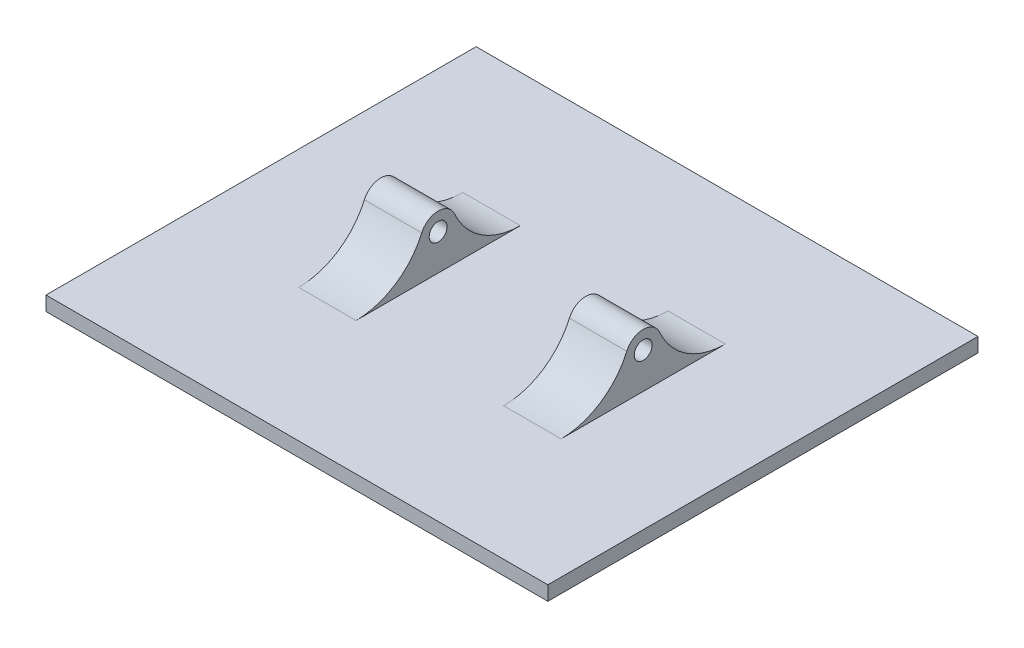
ISO-10303-21;
HEADER;
FILE_DESCRIPTION(('STEP AP214'),'2;1');
FILE_NAME('part.step','',(''),(''),'','','');
FILE_SCHEMA(('AUTOMOTIVE_DESIGN { 1 0 10303 214 1 1 1 1 }'));
ENDSEC;
DATA;
#1=APPLICATION_CONTEXT('core data for automotive mechanical design processes');
#2=APPLICATION_PROTOCOL_DEFINITION('international standard','automotive_design',2000,#1);
#3=PRODUCT_CONTEXT('',#1,'mechanical');
#4=PRODUCT('Part','Part','',(#3));
#5=PRODUCT_RELATED_PRODUCT_CATEGORY('part','',(#4));
#6=PRODUCT_DEFINITION_FORMATION('','',#4);
#7=PRODUCT_DEFINITION_CONTEXT('part definition',#1,'design');
#8=PRODUCT_DEFINITION('design','',#6,#7);
#9=PRODUCT_DEFINITION_SHAPE('','',#8);
#10=(LENGTH_UNIT() NAMED_UNIT(*) SI_UNIT(.MILLI.,.METRE.));
#11=(NAMED_UNIT(*) PLANE_ANGLE_UNIT() SI_UNIT($,.RADIAN.));
#12=(NAMED_UNIT(*) SI_UNIT($,.STERADIAN.) SOLID_ANGLE_UNIT());
#13=UNCERTAINTY_MEASURE_WITH_UNIT(LENGTH_MEASURE(1.E-05),#10,'distance_accuracy_value','');
#14=(GEOMETRIC_REPRESENTATION_CONTEXT(3) GLOBAL_UNCERTAINTY_ASSIGNED_CONTEXT((#13)) GLOBAL_UNIT_ASSIGNED_CONTEXT((#10,
#11,#12)) REPRESENTATION_CONTEXT('',''));
#15=CARTESIAN_POINT('',(0.,0.,0.));
#16=DIRECTION('',(0.,0.,1.));
#17=DIRECTION('',(1.,0.,0.));
#18=AXIS2_PLACEMENT_3D('',#15,#16,#17);
#19=CARTESIAN_POINT('',(27.0710678118655,0.,2.5));
#20=DIRECTION('',(-1.,0.,0.));
#21=DIRECTION('',(0.,0.,1.));
#22=AXIS2_PLACEMENT_3D('',#19,#20,#21);
#23=CYLINDRICAL_SURFACE('',#22,1.25);
#24=CARTESIAN_POINT('',(-24.7,0.,2.5));
#25=DIRECTION('',(-1.,0.,0.));
#26=DIRECTION('',(0.,0.,1.));
#27=AXIS2_PLACEMENT_3D('',#24,#25,#26);
#28=CIRCLE('',#27,1.25);
#29=CARTESIAN_POINT('',(-24.7,0.,3.75));
#30=VERTEX_POINT('',#29);
#31=EDGE_CURVE('E216',#30,#30,#28,.F.);
#32=ORIENTED_EDGE('',*,*,#31,.F.);
#33=EDGE_LOOP('',(#32));
#34=FACE_BOUND('',#33,.T.);
#35=CARTESIAN_POINT('',(-16.7,0.,2.5));
#36=DIRECTION('',(1.,0.,0.));
#37=DIRECTION('',(0.,0.,-1.));
#38=AXIS2_PLACEMENT_3D('',#35,#36,#37);
#39=CIRCLE('',#38,1.25);
#40=CARTESIAN_POINT('',(-16.7,0.,1.25));
#41=VERTEX_POINT('',#40);
#42=EDGE_CURVE('E206',#41,#41,#39,.F.);
#43=ORIENTED_EDGE('',*,*,#42,.F.);
#44=EDGE_LOOP('',(#43));
#45=FACE_BOUND('',#44,.T.);
#46=ADVANCED_FACE('F35',(#34,#45),#23,.F.);
#47=CARTESIAN_POINT('',(-24.7,79.,10.7291332897563));
#48=DIRECTION('',(-1.,0.,0.));
#49=DIRECTION('',(0.,0.,1.));
#50=AXIS2_PLACEMENT_3D('',#47,#48,#49);
#51=PLANE('',#50);
#52=DIRECTION('',(0.,0.,-1.));
#53=VECTOR('',#52,1.);
#54=CARTESIAN_POINT('',(-24.7,-5.,10.7291332897563));
#55=LINE('',#54,#53);
#56=CARTESIAN_POINT('',(-24.7,-5.,13.9564392373896));
#57=VERTEX_POINT('',#56);
#58=CARTESIAN_POINT('',(-24.7,-5.,-8.9564392373896));
#59=VERTEX_POINT('',#58);
#60=EDGE_CURVE('E213',#57,#59,#55,.T.);
#61=ORIENTED_EDGE('',*,*,#60,.F.);
#62=CARTESIAN_POINT('',(-24.7,5.,13.9564392373896));
#63=DIRECTION('',(-1.,0.,0.));
#64=DIRECTION('',(0.,0.,1.));
#65=AXIS2_PLACEMENT_3D('',#62,#63,#64);
#66=CIRCLE('',#65,10.);
#67=CARTESIAN_POINT('',(-24.7,1.,4.79128784747792));
#68=VERTEX_POINT('',#67);
#69=EDGE_CURVE('E182',#57,#68,#66,.F.);
#70=ORIENTED_EDGE('',*,*,#69,.T.);
#71=CARTESIAN_POINT('',(-24.7,0.,2.5));
#72=DIRECTION('',(-1.,0.,0.));
#73=DIRECTION('',(0.,0.,1.));
#74=AXIS2_PLACEMENT_3D('',#71,#72,#73);
#75=CIRCLE('',#74,2.5);
#76=CARTESIAN_POINT('',(-24.7,1.,0.208712152522079));
#77=VERTEX_POINT('',#76);
#78=EDGE_CURVE('E214',#68,#77,#75,.T.);
#79=ORIENTED_EDGE('',*,*,#78,.T.);
#80=CARTESIAN_POINT('',(-24.7,5.,-8.9564392373896));
#81=DIRECTION('',(-1.,0.,0.));
#82=DIRECTION('',(0.,0.,1.));
#83=AXIS2_PLACEMENT_3D('',#80,#81,#82);
#84=CIRCLE('',#83,10.);
#85=EDGE_CURVE('E11',#77,#59,#84,.F.);
#86=ORIENTED_EDGE('',*,*,#85,.T.);
#87=EDGE_LOOP('',(#61,#70,#79,#86));
#88=FACE_BOUND('',#87,.T.);
#89=ORIENTED_EDGE('',*,*,#31,.T.);
#90=EDGE_LOOP('',(#89));
#91=FACE_BOUND('',#90,.T.);
#92=ADVANCED_FACE('F211',(#88,#91),#51,.T.);
#93=CARTESIAN_POINT('',(-45.3,0.,2.5));
#94=DIRECTION('',(1.,0.,0.));
#95=DIRECTION('',(0.,0.,-1.));
#96=AXIS2_PLACEMENT_3D('',#93,#94,#95);
#97=CIRCLE('',#96,1.25);
#98=CARTESIAN_POINT('',(-45.3,0.,1.25));
#99=VERTEX_POINT('',#98);
#100=EDGE_CURVE('E217',#99,#99,#97,.F.);
#101=ORIENTED_EDGE('',*,*,#100,.F.);
#102=EDGE_LOOP('',(#101));
#103=FACE_BOUND('',#102,.T.);
#104=CARTESIAN_POINT('',(-53.3,0.,2.5));
#105=DIRECTION('',(-1.,0.,0.));
#106=DIRECTION('',(0.,0.,1.));
#107=AXIS2_PLACEMENT_3D('',#104,#105,#106);
#108=CIRCLE('',#107,1.25);
#109=CARTESIAN_POINT('',(-53.3,0.,3.75));
#110=VERTEX_POINT('',#109);
#111=EDGE_CURVE('E207',#110,#110,#108,.F.);
#112=ORIENTED_EDGE('',*,*,#111,.F.);
#113=EDGE_LOOP('',(#112));
#114=FACE_BOUND('',#113,.T.);
#115=ADVANCED_FACE('F258',(#103,#114),#23,.F.);
#116=CARTESIAN_POINT('',(-45.3,79.,10.7291332897563));
#117=DIRECTION('',(1.,0.,0.));
#118=DIRECTION('',(0.,0.,-1.));
#119=AXIS2_PLACEMENT_3D('',#116,#117,#118);
#120=PLANE('',#119);
#121=DIRECTION('',(0.,0.,1.));
#122=VECTOR('',#121,1.);
#123=CARTESIAN_POINT('',(-45.3,-5.,10.7291332897563));
#124=LINE('',#123,#122);
#125=CARTESIAN_POINT('',(-45.3,-5.,-8.9564392373896));
#126=VERTEX_POINT('',#125);
#127=CARTESIAN_POINT('',(-45.3,-5.,13.9564392373896));
#128=VERTEX_POINT('',#127);
#129=EDGE_CURVE('E288',#126,#128,#124,.T.);
#130=ORIENTED_EDGE('',*,*,#129,.F.);
#131=CARTESIAN_POINT('',(-45.3,5.,-8.9564392373896));
#132=DIRECTION('',(1.,0.,0.));
#133=DIRECTION('',(0.,0.,-1.));
#134=AXIS2_PLACEMENT_3D('',#131,#132,#133);
#135=CIRCLE('',#134,10.);
#136=CARTESIAN_POINT('',(-45.3,1.,0.208712152522079));
#137=VERTEX_POINT('',#136);
#138=EDGE_CURVE('E58',#126,#137,#135,.F.);
#139=ORIENTED_EDGE('',*,*,#138,.T.);
#140=CARTESIAN_POINT('',(-45.3,0.,2.5));
#141=DIRECTION('',(1.,0.,0.));
#142=DIRECTION('',(0.,0.,-1.));
#143=AXIS2_PLACEMENT_3D('',#140,#141,#142);
#144=CIRCLE('',#143,2.5);
#145=CARTESIAN_POINT('',(-45.3,1.,4.79128784747792));
#146=VERTEX_POINT('',#145);
#147=EDGE_CURVE('E223',#137,#146,#144,.T.);
#148=ORIENTED_EDGE('',*,*,#147,.T.);
#149=CARTESIAN_POINT('',(-45.3,5.,13.9564392373896));
#150=DIRECTION('',(1.,0.,0.));
#151=DIRECTION('',(0.,0.,-1.));
#152=AXIS2_PLACEMENT_3D('',#149,#150,#151);
#153=CIRCLE('',#152,10.);
#154=EDGE_CURVE('E50',#146,#128,#153,.F.);
#155=ORIENTED_EDGE('',*,*,#154,.T.);
#156=EDGE_LOOP('',(#130,#139,#148,#155));
#157=FACE_BOUND('',#156,.T.);
#158=ORIENTED_EDGE('',*,*,#100,.T.);
#159=EDGE_LOOP('',(#158));
#160=FACE_BOUND('',#159,.T.);
#161=ADVANCED_FACE('F268',(#157,#160),#120,.T.);
#162=CARTESIAN_POINT('',(-70.,1.12757025938492E-13,32.5));
#163=DIRECTION('',(0.,0.,1.));
#164=DIRECTION('',(0.,-1.,0.));
#165=AXIS2_PLACEMENT_3D('',#162,#163,#164);
#166=PLANE('',#165);
#167=DIRECTION('',(0.,-1.,0.));
#168=VECTOR('',#167,1.);
#169=CARTESIAN_POINT('',(0.,1.12757025938492E-13,32.5));
#170=LINE('',#169,#168);
#171=CARTESIAN_POINT('',(0.,-5.,32.5));
#172=VERTEX_POINT('',#171);
#173=CARTESIAN_POINT('',(0.,-7.,32.5));
#174=VERTEX_POINT('',#173);
#175=EDGE_CURVE('E233',#172,#174,#170,.T.);
#176=ORIENTED_EDGE('',*,*,#175,.F.);
#177=DIRECTION('',(1.,0.,0.));
#178=VECTOR('',#177,1.);
#179=CARTESIAN_POINT('',(-70.,-5.,32.5));
#180=LINE('',#179,#178);
#181=CARTESIAN_POINT('',(-70.,-5.,32.5));
#182=VERTEX_POINT('',#181);
#183=EDGE_CURVE('E138',#182,#172,#180,.T.);
#184=ORIENTED_EDGE('',*,*,#183,.F.);
#185=DIRECTION('',(0.,-1.,0.));
#186=VECTOR('',#185,1.);
#187=CARTESIAN_POINT('',(-70.,1.12757025938492E-13,32.5));
#188=LINE('',#187,#186);
#189=CARTESIAN_POINT('',(-70.,-7.,32.5));
#190=VERTEX_POINT('',#189);
#191=EDGE_CURVE('E133',#182,#190,#188,.T.);
#192=ORIENTED_EDGE('',*,*,#191,.T.);
#193=DIRECTION('',(1.,0.,0.));
#194=VECTOR('',#193,1.);
#195=CARTESIAN_POINT('',(-70.,-7.,32.5));
#196=LINE('',#195,#194);
#197=EDGE_CURVE('E157',#190,#174,#196,.T.);
#198=ORIENTED_EDGE('',*,*,#197,.T.);
#199=EDGE_LOOP('',(#176,#184,#192,#198));
#200=FACE_BOUND('',#199,.T.);
#201=ADVANCED_FACE('F240',(#200),#166,.T.);
#202=CARTESIAN_POINT('',(-70.,-7.,0.));
#203=DIRECTION('',(0.,-1.,0.));
#204=DIRECTION('',(0.,0.,-1.));
#205=AXIS2_PLACEMENT_3D('',#202,#203,#204);
#206=PLANE('',#205);
#207=DIRECTION('',(0.,0.,-1.));
#208=VECTOR('',#207,1.);
#209=CARTESIAN_POINT('',(0.,-7.,0.));
#210=LINE('',#209,#208);
#211=CARTESIAN_POINT('',(0.,-7.,-27.5));
#212=VERTEX_POINT('',#211);
#213=EDGE_CURVE('E230',#174,#212,#210,.T.);
#214=ORIENTED_EDGE('',*,*,#213,.F.);
#215=ORIENTED_EDGE('',*,*,#197,.F.);
#216=DIRECTION('',(0.,0.,-1.));
#217=VECTOR('',#216,1.);
#218=CARTESIAN_POINT('',(-70.,-7.,0.));
#219=LINE('',#218,#217);
#220=CARTESIAN_POINT('',(-70.,-7.,-27.5));
#221=VERTEX_POINT('',#220);
#222=EDGE_CURVE('E147',#190,#221,#219,.T.);
#223=ORIENTED_EDGE('',*,*,#222,.T.);
#224=DIRECTION('',(1.,0.,0.));
#225=VECTOR('',#224,1.);
#226=CARTESIAN_POINT('',(-70.,-7.,-27.5));
#227=LINE('',#226,#225);
#228=EDGE_CURVE('E145',#221,#212,#227,.T.);
#229=ORIENTED_EDGE('',*,*,#228,.T.);
#230=EDGE_LOOP('',(#214,#215,#223,#229));
#231=FACE_BOUND('',#230,.T.);
#232=ADVANCED_FACE('F242',(#231),#206,.T.);
#233=CARTESIAN_POINT('',(-70.,0.,-27.5));
#234=DIRECTION('',(0.,0.,1.));
#235=DIRECTION('',(1.,0.,0.));
#236=AXIS2_PLACEMENT_3D('',#233,#234,#235);
#237=PLANE('',#236);
#238=DIRECTION('',(0.,-1.,0.));
#239=VECTOR('',#238,1.);
#240=CARTESIAN_POINT('',(0.,0.,-27.5));
#241=LINE('',#240,#239);
#242=CARTESIAN_POINT('',(0.,-5.,-27.5));
#243=VERTEX_POINT('',#242);
#244=EDGE_CURVE('E220',#243,#212,#241,.T.);
#245=ORIENTED_EDGE('',*,*,#244,.T.);
#246=ORIENTED_EDGE('',*,*,#228,.F.);
#247=DIRECTION('',(0.,-1.,0.));
#248=VECTOR('',#247,1.);
#249=CARTESIAN_POINT('',(-70.,0.,-27.5));
#250=LINE('',#249,#248);
#251=CARTESIAN_POINT('',(-70.,-5.,-27.5));
#252=VERTEX_POINT('',#251);
#253=EDGE_CURVE('E130',#252,#221,#250,.T.);
#254=ORIENTED_EDGE('',*,*,#253,.F.);
#255=DIRECTION('',(1.,0.,0.));
#256=VECTOR('',#255,1.);
#257=CARTESIAN_POINT('',(-70.,-5.,-27.5));
#258=LINE('',#257,#256);
#259=EDGE_CURVE('E144',#252,#243,#258,.T.);
#260=ORIENTED_EDGE('',*,*,#259,.T.);
#261=EDGE_LOOP('',(#245,#246,#254,#260));
#262=FACE_BOUND('',#261,.T.);
#263=ADVANCED_FACE('F143',(#262),#237,.F.);
#264=CARTESIAN_POINT('',(-70.,0.,2.5));
#265=DIRECTION('',(1.,0.,0.));
#266=DIRECTION('',(0.,0.,-1.));
#267=AXIS2_PLACEMENT_3D('',#264,#265,#266);
#268=CYLINDRICAL_SURFACE('',#267,2.5);
#269=ORIENTED_EDGE('',*,*,#78,.F.);
#270=DIRECTION('',(1.,0.,0.));
#271=VECTOR('',#270,1.);
#272=CARTESIAN_POINT('',(-70.,1.,4.79128784747792));
#273=LINE('',#272,#271);
#274=CARTESIAN_POINT('',(-16.7,1.,4.79128784747792));
#275=VERTEX_POINT('',#274);
#276=EDGE_CURVE('E155',#68,#275,#273,.T.);
#277=ORIENTED_EDGE('',*,*,#276,.T.);
#278=CARTESIAN_POINT('',(-16.7,0.,2.5));
#279=DIRECTION('',(1.,0.,0.));
#280=DIRECTION('',(0.,0.,-1.));
#281=AXIS2_PLACEMENT_3D('',#278,#279,#280);
#282=CIRCLE('',#281,2.5);
#283=CARTESIAN_POINT('',(-16.7,1.,0.208712152522079));
#284=VERTEX_POINT('',#283);
#285=EDGE_CURVE('E196',#284,#275,#282,.T.);
#286=ORIENTED_EDGE('',*,*,#285,.F.);
#287=DIRECTION('',(1.,0.,0.));
#288=VECTOR('',#287,1.);
#289=CARTESIAN_POINT('',(-70.,1.,0.208712152522079));
#290=LINE('',#289,#288);
#291=EDGE_CURVE('E153',#284,#77,#290,.F.);
#292=ORIENTED_EDGE('',*,*,#291,.T.);
#293=EDGE_LOOP('',(#269,#277,#286,#292));
#294=FACE_BOUND('',#293,.T.);
#295=ADVANCED_FACE('F203',(#294),#268,.T.);
#296=CARTESIAN_POINT('',(-53.3,0.,2.5));
#297=DIRECTION('',(-1.,0.,0.));
#298=DIRECTION('',(0.,0.,1.));
#299=AXIS2_PLACEMENT_3D('',#296,#297,#298);
#300=CIRCLE('',#299,2.5);
#301=CARTESIAN_POINT('',(-53.3,1.,4.79128784747792));
#302=VERTEX_POINT('',#301);
#303=CARTESIAN_POINT('',(-53.3,1.,0.208712152522079));
#304=VERTEX_POINT('',#303);
#305=EDGE_CURVE('E279',#302,#304,#300,.T.);
#306=ORIENTED_EDGE('',*,*,#305,.F.);
#307=DIRECTION('',(1.,0.,0.));
#308=VECTOR('',#307,1.);
#309=CARTESIAN_POINT('',(-70.,1.,4.79128784747792));
#310=LINE('',#309,#308);
#311=EDGE_CURVE('E177',#302,#146,#310,.T.);
#312=ORIENTED_EDGE('',*,*,#311,.T.);
#313=ORIENTED_EDGE('',*,*,#147,.F.);
#314=DIRECTION('',(1.,0.,0.));
#315=VECTOR('',#314,1.);
#316=CARTESIAN_POINT('',(-70.,1.,0.208712152522079));
#317=LINE('',#316,#315);
#318=EDGE_CURVE('E175',#137,#304,#317,.F.);
#319=ORIENTED_EDGE('',*,*,#318,.T.);
#320=EDGE_LOOP('',(#306,#312,#313,#319));
#321=FACE_BOUND('',#320,.T.);
#322=ADVANCED_FACE('F246',(#321),#268,.T.);
#323=CARTESIAN_POINT('',(0.,0.,0.));
#324=DIRECTION('',(-1.,0.,0.));
#325=DIRECTION('',(0.,0.,1.));
#326=AXIS2_PLACEMENT_3D('',#323,#324,#325);
#327=PLANE('',#326);
#328=ORIENTED_EDGE('',*,*,#244,.F.);
#329=DIRECTION('',(0.,0.,1.));
#330=VECTOR('',#329,1.);
#331=CARTESIAN_POINT('',(0.,-5.,0.));
#332=LINE('',#331,#330);
#333=EDGE_CURVE('E148',#243,#172,#332,.T.);
#334=ORIENTED_EDGE('',*,*,#333,.T.);
#335=ORIENTED_EDGE('',*,*,#175,.T.);
#336=ORIENTED_EDGE('',*,*,#213,.T.);
#337=EDGE_LOOP('',(#328,#334,#335,#336));
#338=FACE_BOUND('',#337,.T.);
#339=ADVANCED_FACE('F244',(#338),#327,.F.);
#340=CARTESIAN_POINT('',(-70.,0.,0.));
#341=DIRECTION('',(-1.,0.,0.));
#342=DIRECTION('',(0.,0.,1.));
#343=AXIS2_PLACEMENT_3D('',#340,#341,#342);
#344=PLANE('',#343);
#345=DIRECTION('',(0.,0.,1.));
#346=VECTOR('',#345,1.);
#347=CARTESIAN_POINT('',(-70.,-5.,0.));
#348=LINE('',#347,#346);
#349=EDGE_CURVE('E126',#252,#182,#348,.T.);
#350=ORIENTED_EDGE('',*,*,#349,.F.);
#351=ORIENTED_EDGE('',*,*,#253,.T.);
#352=ORIENTED_EDGE('',*,*,#222,.F.);
#353=ORIENTED_EDGE('',*,*,#191,.F.);
#354=EDGE_LOOP('',(#350,#351,#352,#353));
#355=FACE_BOUND('',#354,.T.);
#356=ADVANCED_FACE('F128',(#355),#344,.T.);
#357=CARTESIAN_POINT('',(-70.,-5.,0.));
#358=DIRECTION('',(0.,-1.,0.));
#359=DIRECTION('',(0.,0.,-1.));
#360=AXIS2_PLACEMENT_3D('',#357,#358,#359);
#361=PLANE('',#360);
#362=ORIENTED_EDGE('',*,*,#183,.T.);
#363=ORIENTED_EDGE('',*,*,#333,.F.);
#364=ORIENTED_EDGE('',*,*,#259,.F.);
#365=ORIENTED_EDGE('',*,*,#349,.T.);
#366=EDGE_LOOP('',(#362,#363,#364,#365));
#367=FACE_BOUND('',#366,.T.);
#368=DIRECTION('',(0.,0.,1.));
#369=VECTOR('',#368,1.);
#370=CARTESIAN_POINT('',(-16.7,-5.,16.9233540521934));
#371=LINE('',#370,#369);
#372=CARTESIAN_POINT('',(-16.7,-5.,-8.9564392373896));
#373=VERTEX_POINT('',#372);
#374=CARTESIAN_POINT('',(-16.7,-5.,13.9564392373896));
#375=VERTEX_POINT('',#374);
#376=EDGE_CURVE('E197',#373,#375,#371,.T.);
#377=ORIENTED_EDGE('',*,*,#376,.T.);
#378=DIRECTION('',(-1.,0.,0.));
#379=VECTOR('',#378,1.);
#380=CARTESIAN_POINT('',(-24.7,-5.,13.9564392373896));
#381=LINE('',#380,#379);
#382=EDGE_CURVE('E172',#375,#57,#381,.T.);
#383=ORIENTED_EDGE('',*,*,#382,.T.);
#384=ORIENTED_EDGE('',*,*,#60,.T.);
#385=DIRECTION('',(-1.,0.,0.));
#386=VECTOR('',#385,1.);
#387=CARTESIAN_POINT('',(-16.7,-5.,-8.9564392373896));
#388=LINE('',#387,#386);
#389=EDGE_CURVE('E163',#59,#373,#388,.F.);
#390=ORIENTED_EDGE('',*,*,#389,.T.);
#391=EDGE_LOOP('',(#377,#383,#384,#390));
#392=FACE_BOUND('',#391,.T.);
#393=ORIENTED_EDGE('',*,*,#129,.T.);
#394=DIRECTION('',(-1.,0.,0.));
#395=VECTOR('',#394,1.);
#396=CARTESIAN_POINT('',(-53.3,-5.,13.9564392373896));
#397=LINE('',#396,#395);
#398=CARTESIAN_POINT('',(-53.3,-5.,13.9564392373896));
#399=VERTEX_POINT('',#398);
#400=EDGE_CURVE('E169',#128,#399,#397,.T.);
#401=ORIENTED_EDGE('',*,*,#400,.T.);
#402=DIRECTION('',(0.,0.,-1.));
#403=VECTOR('',#402,1.);
#404=CARTESIAN_POINT('',(-53.3,-5.,16.9233540521934));
#405=LINE('',#404,#403);
#406=CARTESIAN_POINT('',(-53.3,-5.,-8.9564392373896));
#407=VERTEX_POINT('',#406);
#408=EDGE_CURVE('E298',#399,#407,#405,.T.);
#409=ORIENTED_EDGE('',*,*,#408,.T.);
#410=DIRECTION('',(-1.,0.,0.));
#411=VECTOR('',#410,1.);
#412=CARTESIAN_POINT('',(-45.3,-5.,-8.9564392373896));
#413=LINE('',#412,#411);
#414=EDGE_CURVE('E166',#407,#126,#413,.F.);
#415=ORIENTED_EDGE('',*,*,#414,.T.);
#416=EDGE_LOOP('',(#393,#401,#409,#415));
#417=FACE_BOUND('',#416,.T.);
#418=ADVANCED_FACE('F150',(#367,#392,#417),#361,.F.);
#419=CARTESIAN_POINT('',(-53.3,79.,16.9233540521934));
#420=DIRECTION('',(-1.,0.,0.));
#421=DIRECTION('',(0.,0.,1.));
#422=AXIS2_PLACEMENT_3D('',#419,#420,#421);
#423=PLANE('',#422);
#424=ORIENTED_EDGE('',*,*,#408,.F.);
#425=CARTESIAN_POINT('',(-53.3,5.,13.9564392373896));
#426=DIRECTION('',(-1.,0.,0.));
#427=DIRECTION('',(0.,0.,1.));
#428=AXIS2_PLACEMENT_3D('',#425,#426,#427);
#429=CIRCLE('',#428,10.);
#430=EDGE_CURVE('E185',#399,#302,#429,.F.);
#431=ORIENTED_EDGE('',*,*,#430,.T.);
#432=ORIENTED_EDGE('',*,*,#305,.T.);
#433=CARTESIAN_POINT('',(-53.3,5.,-8.9564392373896));
#434=DIRECTION('',(-1.,0.,0.));
#435=DIRECTION('',(0.,0.,1.));
#436=AXIS2_PLACEMENT_3D('',#433,#434,#435);
#437=CIRCLE('',#436,10.);
#438=EDGE_CURVE('E188',#304,#407,#437,.F.);
#439=ORIENTED_EDGE('',*,*,#438,.T.);
#440=EDGE_LOOP('',(#424,#431,#432,#439));
#441=FACE_BOUND('',#440,.T.);
#442=ORIENTED_EDGE('',*,*,#111,.T.);
#443=EDGE_LOOP('',(#442));
#444=FACE_BOUND('',#443,.T.);
#445=ADVANCED_FACE('F297',(#441,#444),#423,.T.);
#446=CARTESIAN_POINT('',(-16.7,79.,16.9233540521934));
#447=DIRECTION('',(1.,0.,0.));
#448=DIRECTION('',(0.,0.,-1.));
#449=AXIS2_PLACEMENT_3D('',#446,#447,#448);
#450=PLANE('',#449);
#451=ORIENTED_EDGE('',*,*,#376,.F.);
#452=CARTESIAN_POINT('',(-16.7,5.,-8.9564392373896));
#453=DIRECTION('',(1.,0.,0.));
#454=DIRECTION('',(0.,0.,-1.));
#455=AXIS2_PLACEMENT_3D('',#452,#453,#454);
#456=CIRCLE('',#455,10.);
#457=EDGE_CURVE('E43',#373,#284,#456,.F.);
#458=ORIENTED_EDGE('',*,*,#457,.T.);
#459=ORIENTED_EDGE('',*,*,#285,.T.);
#460=CARTESIAN_POINT('',(-16.7,5.,13.9564392373896));
#461=DIRECTION('',(1.,0.,0.));
#462=DIRECTION('',(0.,0.,-1.));
#463=AXIS2_PLACEMENT_3D('',#460,#461,#462);
#464=CIRCLE('',#463,10.);
#465=EDGE_CURVE('E179',#275,#375,#464,.F.);
#466=ORIENTED_EDGE('',*,*,#465,.T.);
#467=EDGE_LOOP('',(#451,#458,#459,#466));
#468=FACE_BOUND('',#467,.T.);
#469=ORIENTED_EDGE('',*,*,#42,.T.);
#470=EDGE_LOOP('',(#469));
#471=FACE_BOUND('',#470,.T.);
#472=ADVANCED_FACE('F194',(#468,#471),#450,.T.);
#473=CARTESIAN_POINT('',(-70.,5.,13.9564392373896));
#474=DIRECTION('',(1.,0.,0.));
#475=DIRECTION('',(0.,0.,-1.));
#476=AXIS2_PLACEMENT_3D('',#473,#474,#475);
#477=CYLINDRICAL_SURFACE('',#476,10.);
#478=ORIENTED_EDGE('',*,*,#69,.F.);
#479=ORIENTED_EDGE('',*,*,#382,.F.);
#480=ORIENTED_EDGE('',*,*,#465,.F.);
#481=ORIENTED_EDGE('',*,*,#276,.F.);
#482=EDGE_LOOP('',(#478,#479,#480,#481));
#483=FACE_BOUND('',#482,.T.);
#484=ADVANCED_FACE('F305',(#483),#477,.F.);
#485=CARTESIAN_POINT('',(-70.,5.,13.9564392373896));
#486=DIRECTION('',(1.,0.,0.));
#487=DIRECTION('',(0.,0.,-1.));
#488=AXIS2_PLACEMENT_3D('',#485,#486,#487);
#489=CYLINDRICAL_SURFACE('',#488,10.);
#490=ORIENTED_EDGE('',*,*,#430,.F.);
#491=ORIENTED_EDGE('',*,*,#400,.F.);
#492=ORIENTED_EDGE('',*,*,#154,.F.);
#493=ORIENTED_EDGE('',*,*,#311,.F.);
#494=EDGE_LOOP('',(#490,#491,#492,#493));
#495=FACE_BOUND('',#494,.T.);
#496=ADVANCED_FACE('F300',(#495),#489,.F.);
#497=CARTESIAN_POINT('',(-70.,5.,-8.9564392373896));
#498=DIRECTION('',(1.,0.,0.));
#499=DIRECTION('',(0.,0.,-1.));
#500=AXIS2_PLACEMENT_3D('',#497,#498,#499);
#501=CYLINDRICAL_SURFACE('',#500,10.);
#502=ORIENTED_EDGE('',*,*,#438,.F.);
#503=ORIENTED_EDGE('',*,*,#318,.F.);
#504=ORIENTED_EDGE('',*,*,#138,.F.);
#505=ORIENTED_EDGE('',*,*,#414,.F.);
#506=EDGE_LOOP('',(#502,#503,#504,#505));
#507=FACE_BOUND('',#506,.T.);
#508=ADVANCED_FACE('F294',(#507),#501,.F.);
#509=CARTESIAN_POINT('',(-70.,5.,-8.9564392373896));
#510=DIRECTION('',(1.,0.,0.));
#511=DIRECTION('',(0.,0.,-1.));
#512=AXIS2_PLACEMENT_3D('',#509,#510,#511);
#513=CYLINDRICAL_SURFACE('',#512,10.);
#514=ORIENTED_EDGE('',*,*,#85,.F.);
#515=ORIENTED_EDGE('',*,*,#291,.F.);
#516=ORIENTED_EDGE('',*,*,#457,.F.);
#517=ORIENTED_EDGE('',*,*,#389,.F.);
#518=EDGE_LOOP('',(#514,#515,#516,#517));
#519=FACE_BOUND('',#518,.T.);
#520=ADVANCED_FACE('F37',(#519),#513,.F.);
#521=CLOSED_SHELL('',(#46,#92,#115,#161,#201,#232,#263,#295,#322,#339,#356,#418,#445,#472,#484,
#496,#508,#520));
#522=MANIFOLD_SOLID_BREP('B2',#521);
#523=ADVANCED_BREP_SHAPE_REPRESENTATION('',(#18,#522),#14);
#524=SHAPE_DEFINITION_REPRESENTATION(#9,#523);
ENDSEC;
END-ISO-10303-21;
